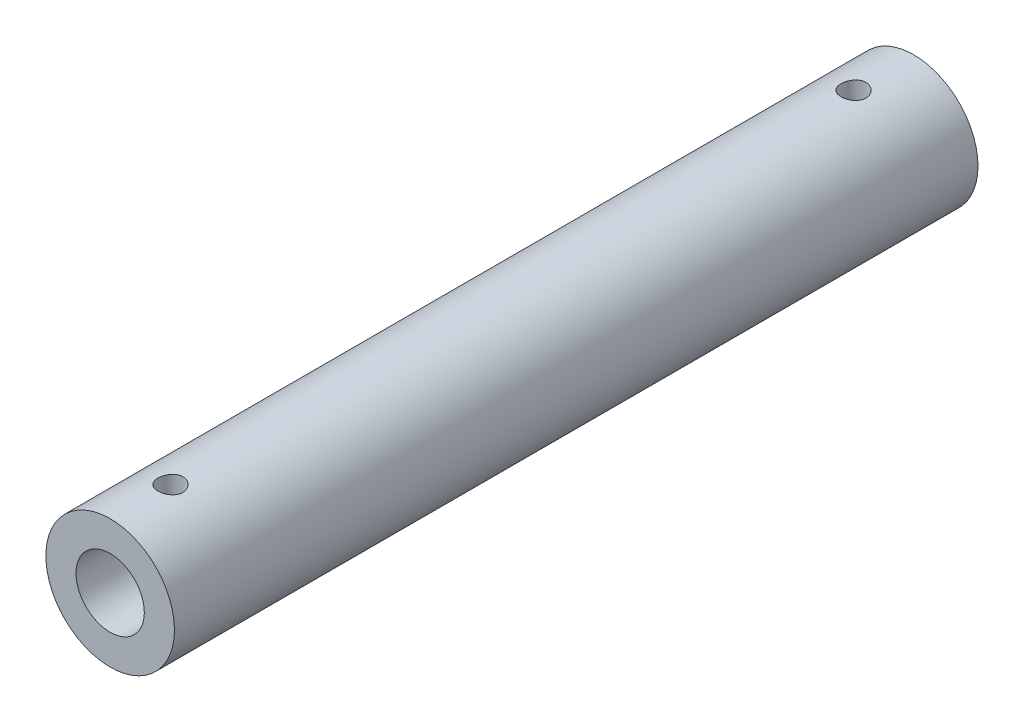
ISO-10303-21;
HEADER;
FILE_DESCRIPTION(('STEP AP214'),'2;1');
FILE_NAME('part.step','',(''),(''),'','','');
FILE_SCHEMA(('AUTOMOTIVE_DESIGN { 1 0 10303 214 1 1 1 1 }'));
ENDSEC;
DATA;
#1=APPLICATION_CONTEXT('core data for automotive mechanical design processes');
#2=APPLICATION_PROTOCOL_DEFINITION('international standard','automotive_design',2000,#1);
#3=PRODUCT_CONTEXT('',#1,'mechanical');
#4=PRODUCT('Part','Part','',(#3));
#5=PRODUCT_RELATED_PRODUCT_CATEGORY('part','',(#4));
#6=PRODUCT_DEFINITION_FORMATION('','',#4);
#7=PRODUCT_DEFINITION_CONTEXT('part definition',#1,'design');
#8=PRODUCT_DEFINITION('design','',#6,#7);
#9=PRODUCT_DEFINITION_SHAPE('','',#8);
#10=(LENGTH_UNIT() NAMED_UNIT(*) SI_UNIT(.MILLI.,.METRE.));
#11=(NAMED_UNIT(*) PLANE_ANGLE_UNIT() SI_UNIT($,.RADIAN.));
#12=(NAMED_UNIT(*) SI_UNIT($,.STERADIAN.) SOLID_ANGLE_UNIT());
#13=UNCERTAINTY_MEASURE_WITH_UNIT(LENGTH_MEASURE(1.E-05),#10,'distance_accuracy_value','');
#14=(GEOMETRIC_REPRESENTATION_CONTEXT(3) GLOBAL_UNCERTAINTY_ASSIGNED_CONTEXT((#13)) GLOBAL_UNIT_ASSIGNED_CONTEXT((#10,
#11,#12)) REPRESENTATION_CONTEXT('',''));
#15=CARTESIAN_POINT('',(0.,0.,0.));
#16=DIRECTION('',(0.,0.,1.));
#17=DIRECTION('',(1.,0.,0.));
#18=AXIS2_PLACEMENT_3D('',#15,#16,#17);
#19=CARTESIAN_POINT('',(0.,0.,-100.));
#20=DIRECTION('',(0.,0.,1.));
#21=DIRECTION('',(1.,0.,0.));
#22=AXIS2_PLACEMENT_3D('',#19,#20,#21);
#23=CYLINDRICAL_SURFACE('',#22,16.);
#24=CARTESIAN_POINT('',(0.,16.,-88.1));
#25=CARTESIAN_POINT('',(-0.172400018112146,15.9999968456064,-88.0999935298753));
#26=CARTESIAN_POINT('',(-0.344883029164546,15.9971848990053,-88.0855699046947));
#27=CARTESIAN_POINT('',(-0.684981234895933,15.9862386155697,-88.0282979104418));
#28=CARTESIAN_POINT('',(-0.852592322333153,15.9780999166224,-87.9854262446817));
#29=CARTESIAN_POINT('',(-1.17797958743562,15.9574097508782,-87.8726261411896));
#30=CARTESIAN_POINT('',(-1.3357647548257,15.9448623895201,-87.8027228697845));
#31=CARTESIAN_POINT('',(-1.63735453579116,15.9167220293397,-87.6379169531352));
#32=CARTESIAN_POINT('',(-1.78116013220058,15.9011292448583,-87.5430160670916));
#33=CARTESIAN_POINT('',(-2.05255470032449,15.8683944156927,-87.3296253502588));
#34=CARTESIAN_POINT('',(-2.17993972734013,15.8512367122421,-87.2108785144865));
#35=CARTESIAN_POINT('',(-2.41311204402029,15.8174209076797,-86.9537193563812));
#36=CARTESIAN_POINT('',(-2.51889771675434,15.8007628440505,-86.8153055630917));
#37=CARTESIAN_POINT('',(-2.70672648568412,15.7696798658713,-86.5212875769414));
#38=CARTESIAN_POINT('',(-2.78856028948406,15.7552751206221,-86.3655473605006));
#39=CARTESIAN_POINT('',(-2.92482206538375,15.7305512478739,-86.0422030560604));
#40=CARTESIAN_POINT('',(-2.97925256938511,15.7202317429418,-85.8746000657433));
#41=CARTESIAN_POINT('',(-3.05850440191016,15.7050047812111,-85.5344760351946));
#42=CARTESIAN_POINT('',(-3.08368246958737,15.7000321749414,-85.3620410935737));
#43=CARTESIAN_POINT('',(-3.10482239355998,15.6958657682352,-85.0153281684222));
#44=CARTESIAN_POINT('',(-3.10078705010488,15.6966714139248,-84.8410503631383));
#45=CARTESIAN_POINT('',(-3.06390355483123,15.7039112280578,-84.4981958412494));
#46=CARTESIAN_POINT('',(-3.03146267555964,15.7102658331955,-84.3295733817728));
#47=CARTESIAN_POINT('',(-2.93933110318012,15.7277624399498,-84.000210568688));
#48=CARTESIAN_POINT('',(-2.87963918128071,15.7389046574459,-83.8394705708741));
#49=CARTESIAN_POINT('',(-2.73430630418927,15.7648033139657,-83.5292526848228));
#50=CARTESIAN_POINT('',(-2.64850238875348,15.779582335459,-83.3798531045363));
#51=CARTESIAN_POINT('',(-2.45349629943699,15.8110746598553,-83.0974193460857));
#52=CARTESIAN_POINT('',(-2.34429159574696,15.8277881718022,-82.9643869397915));
#53=CARTESIAN_POINT('',(-2.1033955184752,15.861611985366,-82.7161122134612));
#54=CARTESIAN_POINT('',(-1.97135615868376,15.8787242267367,-82.6012075356388));
#55=CARTESIAN_POINT('',(-1.68969934988838,15.9111589528458,-82.3951265519364));
#56=CARTESIAN_POINT('',(-1.54008170125096,15.9264814172542,-82.303950515576));
#57=CARTESIAN_POINT('',(-1.22715196450818,15.9536443322074,-82.1478589789125));
#58=CARTESIAN_POINT('',(-1.06382105460123,15.9654798930777,-82.0829803078974));
#59=CARTESIAN_POINT('',(-0.728298252432356,15.9842980154045,-81.9816756927031));
#60=CARTESIAN_POINT('',(-0.556107368742888,15.9912811279311,-81.945246517588));
#61=CARTESIAN_POINT('',(-0.210655679356116,15.9995313338875,-81.9023489140451));
#62=CARTESIAN_POINT('',(-0.0374543269331864,16.0008866274512,-81.8954181381819));
#63=CARTESIAN_POINT('',(0.307631973890054,15.9979727903373,-81.9104714301758));
#64=CARTESIAN_POINT('',(0.479516991064481,15.993703955546,-81.932453976898));
#65=CARTESIAN_POINT('',(0.815612592818184,15.9800765683561,-82.0043256442303));
#66=CARTESIAN_POINT('',(0.97987544645059,15.9707609975382,-82.0539791998503));
#67=CARTESIAN_POINT('',(1.29774441124377,15.9480805821999,-82.1795272568736));
#68=CARTESIAN_POINT('',(1.45134976038428,15.9347154484984,-82.2554236323432));
#69=CARTESIAN_POINT('',(1.74550515636655,15.9051985298092,-82.4323148376324));
#70=CARTESIAN_POINT('',(1.88588342117606,15.8890162670631,-82.5335901353314));
#71=CARTESIAN_POINT('',(2.14781862835063,15.8557352328478,-82.7579867977836));
#72=CARTESIAN_POINT('',(2.26937368319548,15.8386363696963,-82.881110350744));
#73=CARTESIAN_POINT('',(2.49198242490859,15.8051543551885,-83.1478074408912));
#74=CARTESIAN_POINT('',(2.59271964826137,15.7887848565809,-83.2916471310448));
#75=CARTESIAN_POINT('',(2.76860335047014,15.7588967655036,-83.5944781599157));
#76=CARTESIAN_POINT('',(2.84375081816113,15.7453780628816,-83.7534689128642));
#77=CARTESIAN_POINT('',(2.96588132506441,15.7228308818565,-84.0813116555176));
#78=CARTESIAN_POINT('',(3.01300540655566,15.7137799568737,-84.2501094864172));
#79=CARTESIAN_POINT('',(3.07818300321726,15.7011436280101,-84.5934201254523));
#80=CARTESIAN_POINT('',(3.096240047936,15.6975575605462,-84.7679322370887));
#81=CARTESIAN_POINT('',(3.10264669700721,15.6962922080779,-85.1145441633165));
#82=CARTESIAN_POINT('',(3.09149591006535,15.6985135837723,-85.2866345770693));
#83=CARTESIAN_POINT('',(3.04090159079808,15.7083917232253,-85.6264376497712));
#84=CARTESIAN_POINT('',(3.00145825542867,15.7160484491463,-85.794150339187));
#85=CARTESIAN_POINT('',(2.8956152837926,15.735891455948,-86.1201442529647));
#86=CARTESIAN_POINT('',(2.82927328241624,15.7480680475761,-86.2784448179908));
#87=CARTESIAN_POINT('',(2.67157212299308,15.7755849745109,-86.581747452949));
#88=CARTESIAN_POINT('',(2.58021103349811,15.7909255540517,-86.7267484950173));
#89=CARTESIAN_POINT('',(2.37334319348698,15.8233481573614,-87.0018313873299));
#90=CARTESIAN_POINT('',(2.2574742072409,15.8404540754124,-87.1316380610404));
#91=CARTESIAN_POINT('',(2.00563140363589,15.8743048001568,-87.3701316522386));
#92=CARTESIAN_POINT('',(1.86965297449189,15.8910495230036,-87.4788137118607));
#93=CARTESIAN_POINT('',(1.57986614563195,15.9224824943387,-87.6729646970761));
#94=CARTESIAN_POINT('',(1.4258973747536,15.9371491858597,-87.7581978715211));
#95=CARTESIAN_POINT('',(1.1055859248633,15.9625622940216,-87.9014480879311));
#96=CARTESIAN_POINT('',(0.939254802441129,15.9733123179043,-87.9594901869701));
#97=CARTESIAN_POINT('',(0.6437421223258,15.9875398674044,-88.0351926193322));
#98=CARTESIAN_POINT('',(0.516266375684663,15.9921855603691,-88.0594529750441));
#99=CARTESIAN_POINT('',(0.259209352898814,15.9984167689844,-88.0918588683307));
#100=CARTESIAN_POINT('',(0.129628136832459,16.0000023717988,-88.1000048649079));
#101=CARTESIAN_POINT('',(0.,16.,-88.1));
#102=B_SPLINE_CURVE_WITH_KNOTS('',3,(#24,#25,#26,#27,#28,#29,#30,#31,#32,#33,#34,#35,#36,#37,
#38,#39,#40,#41,#42,#43,#44,#45,#46,#47,#48,#49,#50,#51,#52,#53,#54,#55,#56,#57,#58,#59,#60,#61,
#62,#63,#64,#65,#66,#67,#68,#69,#70,#71,#72,#73,#74,#75,#76,#77,#78,#79,#80,#81,#82,#83,#84,#85,
#86,#87,#88,#89,#90,#91,#92,#93,#94,#95,#96,#97,#98,#99,#100,#101),.UNSPECIFIED.,.T.,.F.,(4,2,2,
2,2,2,2,2,2,2,2,2,2,2,2,2,2,2,2,2,2,2,2,2,2,2,2,2,2,2,2,2,2,2,2,2,2,2,4),(0.,0.51672591763908,
1.03387551589591,1.55054480441659,2.06717774218177,2.58971052839545,3.11228241715123,
3.63929284169405,4.16625456467357,4.68672009808957,5.20713574297819,5.72020975490251,
6.23330690440955,6.749674255287,7.26609745772704,7.79122490362682,8.31635831388139,
8.84222464984579,9.36803125584059,9.88556548842532,10.4030724945356,10.9162397868457,
11.4294437333038,11.9485906959877,12.4677896830993,12.9943793639277,13.5209486940572,
14.0448448532419,14.5686773920312,15.0836083659735,15.5985357553053,16.1123656085652,
16.626235140155,17.1483094818336,17.6705037392719,18.1977706603895,18.7245507349377,
19.1130897078369,19.5016176134025),.UNSPECIFIED.);
#103=CARTESIAN_POINT('',(0.,16.,-88.1));
#104=VERTEX_POINT('',#103);
#105=EDGE_CURVE('E74',#104,#104,#102,.T.);
#106=ORIENTED_EDGE('',*,*,#105,.F.);
#107=EDGE_LOOP('',(#106));
#108=FACE_BOUND('',#107,.T.);
#109=CARTESIAN_POINT('',(0.,0.,-100.));
#110=DIRECTION('',(0.,0.,1.));
#111=DIRECTION('',(1.,0.,0.));
#112=AXIS2_PLACEMENT_3D('',#109,#110,#111);
#113=CIRCLE('',#112,16.);
#114=CARTESIAN_POINT('',(16.,0.,-100.));
#115=VERTEX_POINT('',#114);
#116=EDGE_CURVE('E10',#115,#115,#113,.T.);
#117=ORIENTED_EDGE('',*,*,#116,.T.);
#118=EDGE_LOOP('',(#117));
#119=FACE_BOUND('',#118,.T.);
#120=CARTESIAN_POINT('',(0.,0.,100.));
#121=DIRECTION('',(0.,0.,1.));
#122=DIRECTION('',(1.,0.,0.));
#123=AXIS2_PLACEMENT_3D('',#120,#121,#122);
#124=CIRCLE('',#123,16.);
#125=CARTESIAN_POINT('',(16.,0.,100.));
#126=VERTEX_POINT('',#125);
#127=EDGE_CURVE('E63',#126,#126,#124,.T.);
#128=ORIENTED_EDGE('',*,*,#127,.F.);
#129=EDGE_LOOP('',(#128));
#130=FACE_BOUND('',#129,.T.);
#131=CARTESIAN_POINT('',(0.,16.,81.9));
#132=CARTESIAN_POINT('',(0.172400018112146,15.9999968456064,81.9000064701247));
#133=CARTESIAN_POINT('',(0.344883029164546,15.9971848990053,81.9144300953053));
#134=CARTESIAN_POINT('',(0.684981234895933,15.9862386155697,81.9717020895582));
#135=CARTESIAN_POINT('',(0.852592322333153,15.9780999166224,82.0145737553183));
#136=CARTESIAN_POINT('',(1.17797958743562,15.9574097508782,82.1273738588104));
#137=CARTESIAN_POINT('',(1.3357647548257,15.9448623895201,82.1972771302155));
#138=CARTESIAN_POINT('',(1.63735453579116,15.9167220293397,82.3620830468648));
#139=CARTESIAN_POINT('',(1.78116013220058,15.9011292448583,82.4569839329084));
#140=CARTESIAN_POINT('',(2.05255470032449,15.8683944156927,82.6703746497412));
#141=CARTESIAN_POINT('',(2.17993972734013,15.8512367122421,82.7891214855135));
#142=CARTESIAN_POINT('',(2.41311204402029,15.8174209076797,83.0462806436188));
#143=CARTESIAN_POINT('',(2.51889771675434,15.8007628440505,83.1846944369083));
#144=CARTESIAN_POINT('',(2.70672648568412,15.7696798658713,83.4787124230586));
#145=CARTESIAN_POINT('',(2.78856028948406,15.7552751206221,83.6344526394994));
#146=CARTESIAN_POINT('',(2.92482206538375,15.7305512478739,83.9577969439396));
#147=CARTESIAN_POINT('',(2.97925256938511,15.7202317429418,84.1253999342567));
#148=CARTESIAN_POINT('',(3.05850440191016,15.7050047812111,84.4655239648054));
#149=CARTESIAN_POINT('',(3.08368246958738,15.7000321749414,84.6379589064263));
#150=CARTESIAN_POINT('',(3.10482239355998,15.6958657682352,84.9846718315778));
#151=CARTESIAN_POINT('',(3.10078705010488,15.6966714139248,85.1589496368617));
#152=CARTESIAN_POINT('',(3.06390355483123,15.7039112280578,85.5018041587506));
#153=CARTESIAN_POINT('',(3.03146267555963,15.7102658331955,85.6704266182272));
#154=CARTESIAN_POINT('',(2.93933110318011,15.7277624399498,85.999789431312));
#155=CARTESIAN_POINT('',(2.87963918128071,15.7389046574459,86.1605294291259));
#156=CARTESIAN_POINT('',(2.73430630418927,15.7648033139657,86.4707473151772));
#157=CARTESIAN_POINT('',(2.64850238875348,15.779582335459,86.6201468954637));
#158=CARTESIAN_POINT('',(2.45349629943699,15.8110746598553,86.9025806539143));
#159=CARTESIAN_POINT('',(2.34429159574696,15.8277881718022,87.0356130602085));
#160=CARTESIAN_POINT('',(2.1033955184752,15.861611985366,87.2838877865388));
#161=CARTESIAN_POINT('',(1.97135615868376,15.8787242267367,87.3987924643612));
#162=CARTESIAN_POINT('',(1.68969934988838,15.9111589528458,87.6048734480637));
#163=CARTESIAN_POINT('',(1.54008170125096,15.9264814172542,87.696049484424));
#164=CARTESIAN_POINT('',(1.22715196450818,15.9536443322074,87.8521410210876));
#165=CARTESIAN_POINT('',(1.06382105460123,15.9654798930777,87.9170196921026));
#166=CARTESIAN_POINT('',(0.728298252432356,15.9842980154045,88.0183243072969));
#167=CARTESIAN_POINT('',(0.556107368742888,15.9912811279311,88.054753482412));
#168=CARTESIAN_POINT('',(0.210655679356116,15.9995313338875,88.097651085955));
#169=CARTESIAN_POINT('',(0.0374543269331865,16.0008866274512,88.1045818618181));
#170=CARTESIAN_POINT('',(-0.307631973890054,15.9979727903373,88.0895285698242));
#171=CARTESIAN_POINT('',(-0.479516991064481,15.993703955546,88.067546023102));
#172=CARTESIAN_POINT('',(-0.815612592818182,15.9800765683561,87.9956743557697));
#173=CARTESIAN_POINT('',(-0.979875446450587,15.9707609975382,87.9460208001497));
#174=CARTESIAN_POINT('',(-1.29774441124376,15.9480805821999,87.8204727431264));
#175=CARTESIAN_POINT('',(-1.45134976038427,15.9347154484984,87.7445763676568));
#176=CARTESIAN_POINT('',(-1.74550515636655,15.9051985298092,87.5676851623676));
#177=CARTESIAN_POINT('',(-1.88588342117606,15.8890162670631,87.4664098646686));
#178=CARTESIAN_POINT('',(-2.14781862835063,15.8557352328478,87.2420132022164));
#179=CARTESIAN_POINT('',(-2.26937368319548,15.8386363696963,87.118889649256));
#180=CARTESIAN_POINT('',(-2.49198242490859,15.8051543551885,86.8521925591088));
#181=CARTESIAN_POINT('',(-2.59271964826137,15.7887848565809,86.7083528689552));
#182=CARTESIAN_POINT('',(-2.76860335047014,15.7588967655036,86.4055218400843));
#183=CARTESIAN_POINT('',(-2.84375081816113,15.7453780628816,86.2465310871358));
#184=CARTESIAN_POINT('',(-2.96588132506441,15.7228308818565,85.9186883444824));
#185=CARTESIAN_POINT('',(-3.01300540655566,15.7137799568737,85.7498905135828));
#186=CARTESIAN_POINT('',(-3.07818300321726,15.7011436280101,85.4065798745477));
#187=CARTESIAN_POINT('',(-3.096240047936,15.6975575605462,85.2320677629114));
#188=CARTESIAN_POINT('',(-3.10264669700721,15.6962922080779,84.8854558366835));
#189=CARTESIAN_POINT('',(-3.09149591006535,15.6985135837723,84.7133654229307));
#190=CARTESIAN_POINT('',(-3.04090159079808,15.7083917232253,84.3735623502288));
#191=CARTESIAN_POINT('',(-3.00145825542868,15.7160484491463,84.205849660813));
#192=CARTESIAN_POINT('',(-2.8956152837926,15.735891455948,83.8798557470353));
#193=CARTESIAN_POINT('',(-2.82927328241624,15.7480680475761,83.7215551820092));
#194=CARTESIAN_POINT('',(-2.67157212299308,15.7755849745109,83.418252547051));
#195=CARTESIAN_POINT('',(-2.58021103349811,15.7909255540517,83.2732515049827));
#196=CARTESIAN_POINT('',(-2.37334319348698,15.8233481573614,82.9981686126701));
#197=CARTESIAN_POINT('',(-2.2574742072409,15.8404540754124,82.8683619389596));
#198=CARTESIAN_POINT('',(-2.00563140363589,15.8743048001568,82.6298683477614));
#199=CARTESIAN_POINT('',(-1.86965297449189,15.8910495230036,82.5211862881393));
#200=CARTESIAN_POINT('',(-1.57986614563195,15.9224824943387,82.3270353029239));
#201=CARTESIAN_POINT('',(-1.4258973747536,15.9371491858597,82.2418021284789));
#202=CARTESIAN_POINT('',(-1.1055859248633,15.9625622940216,82.0985519120689));
#203=CARTESIAN_POINT('',(-0.939254802441129,15.9733123179043,82.0405098130299));
#204=CARTESIAN_POINT('',(-0.6437421223258,15.9875398674044,81.9648073806678));
#205=CARTESIAN_POINT('',(-0.516266375684663,15.9921855603691,81.9405470249559));
#206=CARTESIAN_POINT('',(-0.259209352898814,15.9984167689844,81.9081411316693));
#207=CARTESIAN_POINT('',(-0.129628136832459,16.0000023717988,81.8999951350921));
#208=CARTESIAN_POINT('',(0.,16.,81.9));
#209=B_SPLINE_CURVE_WITH_KNOTS('',3,(#131,#132,#133,#134,#135,#136,#137,#138,#139,#140,#141,
#142,#143,#144,#145,#146,#147,#148,#149,#150,#151,#152,#153,#154,#155,#156,#157,#158,#159,#160,
#161,#162,#163,#164,#165,#166,#167,#168,#169,#170,#171,#172,#173,#174,#175,#176,#177,#178,#179,
#180,#181,#182,#183,#184,#185,#186,#187,#188,#189,#190,#191,#192,#193,#194,#195,#196,#197,#198,
#199,#200,#201,#202,#203,#204,#205,#206,#207,#208),.UNSPECIFIED.,.T.,.F.,(4,2,2,2,2,2,2,2,2,2,2,
2,2,2,2,2,2,2,2,2,2,2,2,2,2,2,2,2,2,2,2,2,2,2,2,2,2,2,4),(0.,0.51672591763908,1.03387551589591,
1.55054480441659,2.06717774218177,2.58971052839545,3.11228241715123,3.63929284169405,
4.16625456467357,4.68672009808958,5.20713574297819,5.72020975490252,6.23330690440955,
6.749674255287,7.26609745772704,7.79122490362682,8.31635831388139,8.84222464984578,
9.36803125584058,9.88556548842532,10.4030724945356,10.9162397868457,11.4294437333038,
11.9485906959877,12.4677896830993,12.9943793639277,13.5209486940572,14.0448448532419,
14.5686773920312,15.0836083659735,15.5985357553053,16.1123656085652,16.626235140155,
17.1483094818336,17.6705037392719,18.1977706603895,18.7245507349377,19.1130897078369,
19.5016176134025),.UNSPECIFIED.);
#210=CARTESIAN_POINT('',(0.,16.,81.9));
#211=VERTEX_POINT('',#210);
#212=EDGE_CURVE('E73',#211,#211,#209,.T.);
#213=ORIENTED_EDGE('',*,*,#212,.T.);
#214=EDGE_LOOP('',(#213));
#215=FACE_BOUND('',#214,.T.);
#216=ADVANCED_FACE('F43',(#108,#119,#130,#215),#23,.T.);
#217=CARTESIAN_POINT('',(0.,0.,-100.));
#218=DIRECTION('',(0.,0.,1.));
#219=DIRECTION('',(1.,0.,0.));
#220=AXIS2_PLACEMENT_3D('',#217,#218,#219);
#221=CYLINDRICAL_SURFACE('',#220,8.5);
#222=CARTESIAN_POINT('',(0.,8.5,-88.1));
#223=CARTESIAN_POINT('',(-0.16820878034275,8.50000330332943,-88.1000045066641));
#224=CARTESIAN_POINT('',(-0.336385910725585,8.49496276830598,-88.0862659584481));
#225=CARTESIAN_POINT('',(-0.667732074462656,8.47535682426255,-88.0318830322882));
#226=CARTESIAN_POINT('',(-0.830901523269822,8.46079220763877,-87.9912408926989));
#227=CARTESIAN_POINT('',(-1.14740692659803,8.42370647141,-87.8846671830488));
#228=CARTESIAN_POINT('',(-1.30076059467134,8.40120019065622,-87.8187827581687));
#229=CARTESIAN_POINT('',(-1.59423214370623,8.35048680089868,-87.6638276651));
#230=CARTESIAN_POINT('',(-1.73434667596123,8.32227825519847,-87.5747511519888));
#231=CARTESIAN_POINT('',(-2.00303717971333,8.26181012499326,-87.3721669165912));
#232=CARTESIAN_POINT('',(-2.13100512223112,8.22944023974994,-87.257885959406));
#233=CARTESIAN_POINT('',(-2.36644289291936,8.16485637122287,-87.0097786662883));
#234=CARTESIAN_POINT('',(-2.47390693047534,8.1326424344774,-86.8759468276758));
#235=CARTESIAN_POINT('',(-2.66904909770869,8.07075282576403,-86.5867168231458));
#236=CARTESIAN_POINT('',(-2.75588607702145,8.04120844419456,-86.4307202562834));
#237=CARTESIAN_POINT('',(-2.9018233610477,7.98970930617422,-86.1050880836139));
#238=CARTESIAN_POINT('',(-2.96093406275016,7.9677517055952,-85.9354576183342));
#239=CARTESIAN_POINT('',(-3.04737074616835,7.93508687533907,-85.5943538905082));
#240=CARTESIAN_POINT('',(-3.07585219412785,7.92397225374324,-85.4232137145991));
#241=CARTESIAN_POINT('',(-3.10383502087162,7.91305606306469,-85.0782500867579));
#242=CARTESIAN_POINT('',(-3.1033475510313,7.91325014077939,-84.9044276930862));
#243=CARTESIAN_POINT('',(-3.07429334264393,7.92457666379486,-84.5694122931853));
#244=CARTESIAN_POINT('',(-3.04730382315146,7.93509468527411,-84.4080579409252));
#245=CARTESIAN_POINT('',(-2.96861019072435,7.96486690500503,-84.0923492543396));
#246=CARTESIAN_POINT('',(-2.91690255910665,7.98412234702983,-83.9379959200522));
#247=CARTESIAN_POINT('',(-2.78933291158371,8.02958669395127,-83.637362693726));
#248=CARTESIAN_POINT('',(-2.71304717999003,8.05591611997855,-83.4912816252214));
#249=CARTESIAN_POINT('',(-2.53878168854096,8.11251897823334,-83.2135258844933));
#250=CARTESIAN_POINT('',(-2.44079473230046,8.14279371739986,-83.0818560128874));
#251=CARTESIAN_POINT('',(-2.21860044870948,8.2062149195887,-82.8278942818684));
#252=CARTESIAN_POINT('',(-2.0931260818792,8.2394218612361,-82.706723473194));
#253=CARTESIAN_POINT('',(-1.82324746516851,8.30331123320867,-82.4868206349267));
#254=CARTESIAN_POINT('',(-1.67884061689474,8.3339933160664,-82.3880916904672));
#255=CARTESIAN_POINT('',(-1.37246158175478,8.38992842929994,-82.2147275320537));
#256=CARTESIAN_POINT('',(-1.2102728937194,8.41509995470182,-82.1404467793809));
#257=CARTESIAN_POINT('',(-0.87455683809697,8.45657705284118,-82.0205905545074));
#258=CARTESIAN_POINT('',(-0.701034256352307,8.47288634097442,-81.9750030517054));
#259=CARTESIAN_POINT('',(-0.357025462167492,8.49415785698372,-81.915938810383));
#260=CARTESIAN_POINT('',(-0.186831369023554,8.49965347470316,-81.9009511908329));
#261=CARTESIAN_POINT('',(0.153707898907413,8.50031425597664,-81.8991372903226));
#262=CARTESIAN_POINT('',(0.324053034988438,8.4954815641975,-81.9123051628927));
#263=CARTESIAN_POINT('',(0.653654363901404,8.47638108848431,-81.9652668755634));
#264=CARTESIAN_POINT('',(0.81308907383821,8.46245853804765,-82.0040870684992));
#265=CARTESIAN_POINT('',(1.12308319282779,8.42692383556152,-82.1059861953882));
#266=CARTESIAN_POINT('',(1.27364144440073,8.40531068324039,-82.1690682850309));
#267=CARTESIAN_POINT('',(1.56645008940043,8.35577218069039,-82.3196793920271));
#268=CARTESIAN_POINT('',(1.7083374395578,8.32768329514541,-82.4078588061599));
#269=CARTESIAN_POINT('',(1.97576455661224,8.26832202253592,-82.6054195758211));
#270=CARTESIAN_POINT('',(2.10129850323962,8.23704850906132,-82.7148084456359));
#271=CARTESIAN_POINT('',(2.33964318008573,8.17264624107629,-82.9587474180598));
#272=CARTESIAN_POINT('',(2.45137948789205,8.13950974724255,-83.0943479598732));
#273=CARTESIAN_POINT('',(2.65070303860821,8.07680160576374,-83.3830459178885));
#274=CARTESIAN_POINT('',(2.73828871221783,8.04723018984649,-83.5361444701915));
#275=CARTESIAN_POINT('',(2.88676139829111,7.99517647028327,-83.8564024929074));
#276=CARTESIAN_POINT('',(2.94758688320152,7.97271053666835,-84.0235933246159));
#277=CARTESIAN_POINT('',(3.03985292479672,7.93799543415209,-84.3668835812834));
#278=CARTESIAN_POINT('',(3.07131033330236,7.92574040652201,-84.5429778360994));
#279=CARTESIAN_POINT('',(3.10248656674396,7.91358515382526,-84.8875060284317));
#280=CARTESIAN_POINT('',(3.1040247164164,7.91297676059042,-85.0557518379553));
#281=CARTESIAN_POINT('',(3.07993305291218,7.92238450171551,-85.3899681506293));
#282=CARTESIAN_POINT('',(3.05430553842881,7.93239973712953,-85.5559388450908));
#283=CARTESIAN_POINT('',(2.97799615180573,7.96135185169711,-85.8763166867665));
#284=CARTESIAN_POINT('',(2.92801702894929,7.9800378254881,-86.0309157908528));
#285=CARTESIAN_POINT('',(2.80502804949309,8.024092707938,-86.329633750318));
#286=CARTESIAN_POINT('',(2.73201252801623,8.04946326014722,-86.4737500171259));
#287=CARTESIAN_POINT('',(2.56075408645919,8.10561763380134,-86.7552880786516));
#288=CARTESIAN_POINT('',(2.46142676303745,8.13660958507032,-86.8920082760186));
#289=CARTESIAN_POINT('',(2.24208160553476,8.19976115687159,-87.147423495483));
#290=CARTESIAN_POINT('',(2.1220573800498,8.23192113567321,-87.2661129281453));
#291=CARTESIAN_POINT('',(1.85753618950579,8.29571861109255,-87.4881382674633));
#292=CARTESIAN_POINT('',(1.7121150064077,8.32724939112082,-87.590408372575));
#293=CARTESIAN_POINT('',(1.40505398832088,8.38452063660028,-87.7689999398011));
#294=CARTESIAN_POINT('',(1.24341435970842,8.41026117571755,-87.8453217320481));
#295=CARTESIAN_POINT('',(0.904898872317055,8.45345017071483,-87.9705842831133));
#296=CARTESIAN_POINT('',(0.727778602711782,8.47071782450847,-88.0189316665711));
#297=CARTESIAN_POINT('',(0.367091106517178,8.4939884912329,-88.0836301191901));
#298=CARTESIAN_POINT('',(0.183526714840704,8.49999639585284,-88.0999950829365));
#299=CARTESIAN_POINT('',(0.,8.5,-88.1));
#300=B_SPLINE_CURVE_WITH_KNOTS('',3,(#222,#223,#224,#225,#226,#227,#228,#229,#230,#231,#232,
#233,#234,#235,#236,#237,#238,#239,#240,#241,#242,#243,#244,#245,#246,#247,#248,#249,#250,#251,
#252,#253,#254,#255,#256,#257,#258,#259,#260,#261,#262,#263,#264,#265,#266,#267,#268,#269,#270,
#271,#272,#273,#274,#275,#276,#277,#278,#279,#280,#281,#282,#283,#284,#285,#286,#287,#288,#289,
#290,#291,#292,#293,#294,#295,#296,#297,#298,#299),.UNSPECIFIED.,.T.,.F.,(4,2,2,2,2,2,2,2,2,2,2,
2,2,2,2,2,2,2,2,2,2,2,2,2,2,2,2,2,2,2,2,2,2,2,2,2,2,2,4),(0.,0.503949784278444,1.00785764566014,
1.51082890722651,2.01392705165726,2.53539299141199,3.05700598379402,3.5971993561857,
4.13719000091582,4.65600630788475,5.1746229015625,5.66413703197671,6.15372086667174,
6.65224224587309,7.15092918890521,7.68117987310531,8.21150340803124,8.74920798363737,
9.28668695823319,9.79691482002953,10.3070367436323,10.7988304140847,11.2906880726622,
11.7966792895764,12.302850102496,12.8367630264841,13.3707106357858,13.9058795726157,
14.440741232793,14.9429701175087,15.4451565082138,15.9336395626702,16.4222428336667,
16.935428342398,17.4487726125272,17.9878105218988,18.5268415729972,19.0769225829428,
19.626764560067),.UNSPECIFIED.);
#301=CARTESIAN_POINT('',(0.,8.5,-88.1));
#302=VERTEX_POINT('',#301);
#303=EDGE_CURVE('E47',#302,#302,#300,.T.);
#304=ORIENTED_EDGE('',*,*,#303,.T.);
#305=EDGE_LOOP('',(#304));
#306=FACE_BOUND('',#305,.T.);
#307=CARTESIAN_POINT('',(0.,0.,-100.));
#308=DIRECTION('',(0.,0.,1.));
#309=DIRECTION('',(1.,0.,0.));
#310=AXIS2_PLACEMENT_3D('',#307,#308,#309);
#311=CIRCLE('',#310,8.5);
#312=CARTESIAN_POINT('',(8.5,0.,-100.));
#313=VERTEX_POINT('',#312);
#314=EDGE_CURVE('E57',#313,#313,#311,.T.);
#315=ORIENTED_EDGE('',*,*,#314,.F.);
#316=EDGE_LOOP('',(#315));
#317=FACE_BOUND('',#316,.T.);
#318=CARTESIAN_POINT('',(0.,0.,100.));
#319=DIRECTION('',(0.,0.,1.));
#320=DIRECTION('',(1.,0.,0.));
#321=AXIS2_PLACEMENT_3D('',#318,#319,#320);
#322=CIRCLE('',#321,8.5);
#323=CARTESIAN_POINT('',(8.5,0.,100.));
#324=VERTEX_POINT('',#323);
#325=EDGE_CURVE('E94',#324,#324,#322,.T.);
#326=ORIENTED_EDGE('',*,*,#325,.T.);
#327=EDGE_LOOP('',(#326));
#328=FACE_BOUND('',#327,.T.);
#329=CARTESIAN_POINT('',(0.,8.5,81.9));
#330=CARTESIAN_POINT('',(0.168208780342749,8.50000330332943,81.8999954933359));
#331=CARTESIAN_POINT('',(0.336385910725584,8.49496276830598,81.9137340415519));
#332=CARTESIAN_POINT('',(0.667732074462654,8.47535682426255,81.9681169677118));
#333=CARTESIAN_POINT('',(0.830901523269822,8.46079220763877,82.0087591073011));
#334=CARTESIAN_POINT('',(1.14740692659803,8.42370647141,82.1153328169512));
#335=CARTESIAN_POINT('',(1.30076059467134,8.40120019065622,82.1812172418313));
#336=CARTESIAN_POINT('',(1.59423214370623,8.35048680089868,82.3361723349));
#337=CARTESIAN_POINT('',(1.73434667596123,8.32227825519847,82.4252488480112));
#338=CARTESIAN_POINT('',(2.00303717971333,8.26181012499326,82.6278330834088));
#339=CARTESIAN_POINT('',(2.13100512223112,8.22944023974994,82.7421140405941));
#340=CARTESIAN_POINT('',(2.36644289291936,8.16485637122287,82.9902213337118));
#341=CARTESIAN_POINT('',(2.47390693047534,8.1326424344774,83.1240531723242));
#342=CARTESIAN_POINT('',(2.66904909770869,8.07075282576403,83.4132831768542));
#343=CARTESIAN_POINT('',(2.75588607702145,8.04120844419456,83.5692797437166));
#344=CARTESIAN_POINT('',(2.9018233610477,7.98970930617422,83.8949119163861));
#345=CARTESIAN_POINT('',(2.96093406275016,7.9677517055952,84.0645423816658));
#346=CARTESIAN_POINT('',(3.04737074616835,7.93508687533907,84.4056461094918));
#347=CARTESIAN_POINT('',(3.07585219412785,7.92397225374324,84.576786285401));
#348=CARTESIAN_POINT('',(3.10383502087162,7.91305606306469,84.9217499132421));
#349=CARTESIAN_POINT('',(3.1033475510313,7.91325014077939,85.0955723069138));
#350=CARTESIAN_POINT('',(3.07429334264393,7.92457666379486,85.4305877068147));
#351=CARTESIAN_POINT('',(3.04730382315146,7.93509468527411,85.5919420590748));
#352=CARTESIAN_POINT('',(2.96861019072435,7.96486690500503,85.9076507456604));
#353=CARTESIAN_POINT('',(2.91690255910665,7.98412234702983,86.0620040799478));
#354=CARTESIAN_POINT('',(2.78933291158371,8.02958669395127,86.362637306274));
#355=CARTESIAN_POINT('',(2.71304717999003,8.05591611997855,86.5087183747787));
#356=CARTESIAN_POINT('',(2.53878168854096,8.11251897823334,86.7864741155067));
#357=CARTESIAN_POINT('',(2.44079473230046,8.14279371739986,86.9181439871126));
#358=CARTESIAN_POINT('',(2.21860044870948,8.2062149195887,87.1721057181317));
#359=CARTESIAN_POINT('',(2.0931260818792,8.2394218612361,87.293276526806));
#360=CARTESIAN_POINT('',(1.82324746516851,8.30331123320867,87.5131793650733));
#361=CARTESIAN_POINT('',(1.67884061689474,8.3339933160664,87.6119083095329));
#362=CARTESIAN_POINT('',(1.37246158175478,8.38992842929994,87.7852724679463));
#363=CARTESIAN_POINT('',(1.21027289371939,8.41509995470182,87.8595532206191));
#364=CARTESIAN_POINT('',(0.874556838096963,8.45657705284118,87.9794094454926));
#365=CARTESIAN_POINT('',(0.701034256352304,8.47288634097442,88.0249969482946));
#366=CARTESIAN_POINT('',(0.357025462167492,8.49415785698372,88.084061189617));
#367=CARTESIAN_POINT('',(0.186831369023554,8.49965347470316,88.0990488091671));
#368=CARTESIAN_POINT('',(-0.153707898907413,8.50031425597664,88.1008627096774));
#369=CARTESIAN_POINT('',(-0.324053034988438,8.4954815641975,88.0876948371073));
#370=CARTESIAN_POINT('',(-0.653654363901403,8.47638108848431,88.0347331244366));
#371=CARTESIAN_POINT('',(-0.813089073838207,8.46245853804765,87.9959129315008));
#372=CARTESIAN_POINT('',(-1.12308319282778,8.42692383556152,87.8940138046118));
#373=CARTESIAN_POINT('',(-1.27364144440073,8.40531068324039,87.8309317149691));
#374=CARTESIAN_POINT('',(-1.56645008940043,8.35577218069039,87.6803206079729));
#375=CARTESIAN_POINT('',(-1.7083374395578,8.32768329514541,87.5921411938401));
#376=CARTESIAN_POINT('',(-1.97576455661224,8.26832202253592,87.3945804241789));
#377=CARTESIAN_POINT('',(-2.10129850323962,8.23704850906132,87.2851915543641));
#378=CARTESIAN_POINT('',(-2.33964318008572,8.17264624107629,87.0412525819402));
#379=CARTESIAN_POINT('',(-2.45137948789204,8.13950974724255,86.9056520401268));
#380=CARTESIAN_POINT('',(-2.6507030386082,8.07680160576375,86.6169540821115));
#381=CARTESIAN_POINT('',(-2.73828871221783,8.04723018984649,86.4638555298085));
#382=CARTESIAN_POINT('',(-2.88676139829111,7.99517647028327,86.1435975070926));
#383=CARTESIAN_POINT('',(-2.94758688320152,7.97271053666835,85.9764066753841));
#384=CARTESIAN_POINT('',(-3.03985292479672,7.93799543415209,85.6331164187166));
#385=CARTESIAN_POINT('',(-3.07131033330236,7.92574040652201,85.4570221639006));
#386=CARTESIAN_POINT('',(-3.10248656674396,7.91358515382526,85.1124939715683));
#387=CARTESIAN_POINT('',(-3.1040247164164,7.91297676059042,84.9442481620447));
#388=CARTESIAN_POINT('',(-3.07993305291218,7.92238450171551,84.6100318493707));
#389=CARTESIAN_POINT('',(-3.05430553842881,7.93239973712953,84.4440611549092));
#390=CARTESIAN_POINT('',(-2.97799615180573,7.96135185169711,84.1236833132335));
#391=CARTESIAN_POINT('',(-2.92801702894929,7.9800378254881,83.9690842091472));
#392=CARTESIAN_POINT('',(-2.80502804949309,8.024092707938,83.670366249682));
#393=CARTESIAN_POINT('',(-2.73201252801623,8.04946326014722,83.5262499828741));
#394=CARTESIAN_POINT('',(-2.56075408645919,8.10561763380134,83.2447119213484));
#395=CARTESIAN_POINT('',(-2.46142676303745,8.13660958507032,83.1079917239814));
#396=CARTESIAN_POINT('',(-2.24208160553476,8.19976115687159,82.852576504517));
#397=CARTESIAN_POINT('',(-2.1220573800498,8.23192113567321,82.7338870718548));
#398=CARTESIAN_POINT('',(-1.85753618950579,8.29571861109255,82.5118617325367));
#399=CARTESIAN_POINT('',(-1.7121150064077,8.32724939112082,82.409591627425));
#400=CARTESIAN_POINT('',(-1.40505398832088,8.38452063660028,82.2310000601989));
#401=CARTESIAN_POINT('',(-1.24341435970842,8.41026117571755,82.1546782679519));
#402=CARTESIAN_POINT('',(-0.904898872317054,8.45345017071484,82.0294157168867));
#403=CARTESIAN_POINT('',(-0.727778602711781,8.47071782450847,81.9810683334289));
#404=CARTESIAN_POINT('',(-0.367091106517177,8.4939884912329,81.9163698808099));
#405=CARTESIAN_POINT('',(-0.183526714840703,8.49999639585284,81.9000049170635));
#406=CARTESIAN_POINT('',(0.,8.5,81.9));
#407=B_SPLINE_CURVE_WITH_KNOTS('',3,(#329,#330,#331,#332,#333,#334,#335,#336,#337,#338,#339,
#340,#341,#342,#343,#344,#345,#346,#347,#348,#349,#350,#351,#352,#353,#354,#355,#356,#357,#358,
#359,#360,#361,#362,#363,#364,#365,#366,#367,#368,#369,#370,#371,#372,#373,#374,#375,#376,#377,
#378,#379,#380,#381,#382,#383,#384,#385,#386,#387,#388,#389,#390,#391,#392,#393,#394,#395,#396,
#397,#398,#399,#400,#401,#402,#403,#404,#405,#406),.UNSPECIFIED.,.T.,.F.,(4,2,2,2,2,2,2,2,2,2,2,
2,2,2,2,2,2,2,2,2,2,2,2,2,2,2,2,2,2,2,2,2,2,2,2,2,2,2,4),(0.,0.503949784278442,1.00785764566014,
1.51082890722651,2.01392705165726,2.53539299141199,3.05700598379402,3.59719935618572,
4.13719000091582,4.65600630788476,5.1746229015625,5.66413703197671,6.15372086667174,
6.65224224587309,7.15092918890521,7.68117987310531,8.21150340803124,8.74920798363738,
9.28668695823319,9.79691482002953,10.3070367436323,10.7988304140847,11.2906880726622,
11.7966792895764,12.302850102496,12.8367630264841,13.3707106357858,13.9058795726157,
14.440741232793,14.9429701175087,15.4451565082138,15.9336395626702,16.4222428336667,
16.935428342398,17.4487726125272,17.9878105218988,18.5268415729972,19.0769225829428,
19.626764560067),.UNSPECIFIED.);
#408=CARTESIAN_POINT('',(0.,8.5,81.9));
#409=VERTEX_POINT('',#408);
#410=EDGE_CURVE('E66',#409,#409,#407,.T.);
#411=ORIENTED_EDGE('',*,*,#410,.F.);
#412=EDGE_LOOP('',(#411));
#413=FACE_BOUND('',#412,.T.);
#414=ADVANCED_FACE('F75',(#306,#317,#328,#413),#221,.F.);
#415=CARTESIAN_POINT('',(0.,0.,-100.));
#416=DIRECTION('',(0.,0.,1.));
#417=DIRECTION('',(1.,0.,0.));
#418=AXIS2_PLACEMENT_3D('',#415,#416,#417);
#419=PLANE('',#418);
#420=ORIENTED_EDGE('',*,*,#314,.T.);
#421=EDGE_LOOP('',(#420));
#422=FACE_BOUND('',#421,.T.);
#423=ORIENTED_EDGE('',*,*,#116,.F.);
#424=EDGE_LOOP('',(#423));
#425=FACE_BOUND('',#424,.T.);
#426=ADVANCED_FACE('F114',(#422,#425),#419,.F.);
#427=CARTESIAN_POINT('',(0.,0.,100.));
#428=DIRECTION('',(0.,0.,1.));
#429=DIRECTION('',(1.,0.,0.));
#430=AXIS2_PLACEMENT_3D('',#427,#428,#429);
#431=PLANE('',#430);
#432=ORIENTED_EDGE('',*,*,#127,.T.);
#433=EDGE_LOOP('',(#432));
#434=FACE_BOUND('',#433,.T.);
#435=ORIENTED_EDGE('',*,*,#325,.F.);
#436=EDGE_LOOP('',(#435));
#437=FACE_BOUND('',#436,.T.);
#438=ADVANCED_FACE('F82',(#434,#437),#431,.T.);
#439=CARTESIAN_POINT('',(0.,16.,85.));
#440=DIRECTION('',(0.,-1.,0.));
#441=DIRECTION('',(0.,0.,-1.));
#442=AXIS2_PLACEMENT_3D('',#439,#440,#441);
#443=CYLINDRICAL_SURFACE('',#442,3.1);
#444=ORIENTED_EDGE('',*,*,#212,.F.);
#445=EDGE_LOOP('',(#444));
#446=FACE_BOUND('',#445,.T.);
#447=ORIENTED_EDGE('',*,*,#410,.T.);
#448=EDGE_LOOP('',(#447));
#449=FACE_BOUND('',#448,.T.);
#450=ADVANCED_FACE('F78',(#446,#449),#443,.F.);
#451=CARTESIAN_POINT('',(0.,16.,-85.));
#452=DIRECTION('',(0.,-1.,0.));
#453=DIRECTION('',(0.,0.,-1.));
#454=AXIS2_PLACEMENT_3D('',#451,#452,#453);
#455=CYLINDRICAL_SURFACE('',#454,3.1);
#456=ORIENTED_EDGE('',*,*,#105,.T.);
#457=EDGE_LOOP('',(#456));
#458=FACE_BOUND('',#457,.T.);
#459=ORIENTED_EDGE('',*,*,#303,.F.);
#460=EDGE_LOOP('',(#459));
#461=FACE_BOUND('',#460,.T.);
#462=ADVANCED_FACE('F81',(#458,#461),#455,.F.);
#463=CLOSED_SHELL('',(#216,#414,#426,#438,#450,#462));
#464=MANIFOLD_SOLID_BREP('B2',#463);
#465=ADVANCED_BREP_SHAPE_REPRESENTATION('',(#18,#464),#14);
#466=SHAPE_DEFINITION_REPRESENTATION(#9,#465);
ENDSEC;
END-ISO-10303-21;
